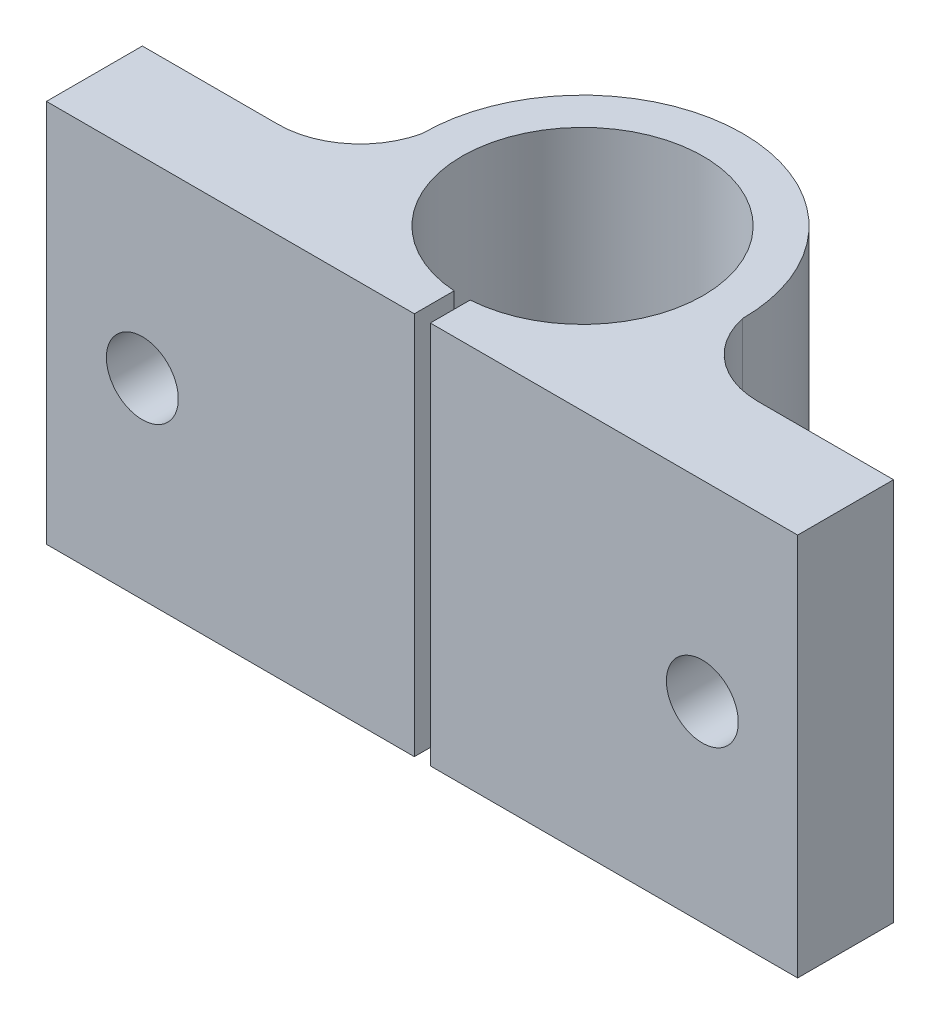
ISO-10303-21;
HEADER;
FILE_DESCRIPTION(('STEP AP214'),'2;1');
FILE_NAME('part.step','',(''),(''),'','','');
FILE_SCHEMA(('AUTOMOTIVE_DESIGN { 1 0 10303 214 1 1 1 1 }'));
ENDSEC;
DATA;
#1=APPLICATION_CONTEXT('core data for automotive mechanical design processes');
#2=APPLICATION_PROTOCOL_DEFINITION('international standard','automotive_design',2000,#1);
#3=PRODUCT_CONTEXT('',#1,'mechanical');
#4=PRODUCT('Part','Part','',(#3));
#5=PRODUCT_RELATED_PRODUCT_CATEGORY('part','',(#4));
#6=PRODUCT_DEFINITION_FORMATION('','',#4);
#7=PRODUCT_DEFINITION_CONTEXT('part definition',#1,'design');
#8=PRODUCT_DEFINITION('design','',#6,#7);
#9=PRODUCT_DEFINITION_SHAPE('','',#8);
#10=(LENGTH_UNIT() NAMED_UNIT(*) SI_UNIT(.MILLI.,.METRE.));
#11=(NAMED_UNIT(*) PLANE_ANGLE_UNIT() SI_UNIT($,.RADIAN.));
#12=(NAMED_UNIT(*) SI_UNIT($,.STERADIAN.) SOLID_ANGLE_UNIT());
#13=UNCERTAINTY_MEASURE_WITH_UNIT(LENGTH_MEASURE(1.E-05),#10,'distance_accuracy_value','');
#14=(GEOMETRIC_REPRESENTATION_CONTEXT(3) GLOBAL_UNCERTAINTY_ASSIGNED_CONTEXT((#13)) GLOBAL_UNIT_ASSIGNED_CONTEXT((#10,
#11,#12)) REPRESENTATION_CONTEXT('',''));
#15=CARTESIAN_POINT('',(0.,0.,0.));
#16=DIRECTION('',(0.,0.,1.));
#17=DIRECTION('',(1.,0.,0.));
#18=AXIS2_PLACEMENT_3D('',#15,#16,#17);
#19=CARTESIAN_POINT('',(41.0372666212457,12.,0.));
#20=DIRECTION('',(0.,0.,-1.));
#21=DIRECTION('',(-1.,0.,0.));
#22=AXIS2_PLACEMENT_3D('',#19,#20,#21);
#23=CYLINDRICAL_SURFACE('',#22,2.25000000000008);
#24=CARTESIAN_POINT('',(41.0372666212457,12.,0.));
#25=DIRECTION('',(0.,0.,-1.));
#26=DIRECTION('',(-1.,0.,0.));
#27=AXIS2_PLACEMENT_3D('',#24,#25,#26);
#28=CIRCLE('',#27,2.25000000000008);
#29=CARTESIAN_POINT('',(38.7872666212456,12.,0.));
#30=VERTEX_POINT('',#29);
#31=EDGE_CURVE('E143',#30,#30,#28,.T.);
#32=ORIENTED_EDGE('',*,*,#31,.F.);
#33=EDGE_LOOP('',(#32));
#34=FACE_BOUND('',#33,.T.);
#35=CARTESIAN_POINT('',(41.0372666212457,12.,-6.));
#36=DIRECTION('',(0.,0.,-1.));
#37=DIRECTION('',(-1.,0.,0.));
#38=AXIS2_PLACEMENT_3D('',#35,#36,#37);
#39=CIRCLE('',#38,2.25000000000008);
#40=CARTESIAN_POINT('',(38.7872666212456,12.,-6.));
#41=VERTEX_POINT('',#40);
#42=EDGE_CURVE('E20',#41,#41,#39,.F.);
#43=ORIENTED_EDGE('',*,*,#42,.F.);
#44=EDGE_LOOP('',(#43));
#45=FACE_BOUND('',#44,.T.);
#46=ADVANCED_FACE('F16',(#34,#45),#23,.F.);
#47=CARTESIAN_POINT('',(24.0186333106229,0.,0.));
#48=DIRECTION('',(-1.,0.,0.));
#49=DIRECTION('',(0.,1.,0.));
#50=AXIS2_PLACEMENT_3D('',#47,#48,#49);
#51=PLANE('',#50);
#52=DIRECTION('',(0.,-1.,0.));
#53=VECTOR('',#52,1.);
#54=CARTESIAN_POINT('',(24.0186333106229,12.,0.));
#55=LINE('',#54,#53);
#56=CARTESIAN_POINT('',(24.0186333106229,24.,0.));
#57=VERTEX_POINT('',#56);
#58=CARTESIAN_POINT('',(24.0186333106229,0.,0.));
#59=VERTEX_POINT('',#58);
#60=EDGE_CURVE('E153',#57,#59,#55,.T.);
#61=ORIENTED_EDGE('',*,*,#60,.F.);
#62=DIRECTION('',(0.,0.,1.));
#63=VECTOR('',#62,1.);
#64=CARTESIAN_POINT('',(24.0186333106229,24.,-10.1229485983166));
#65=LINE('',#64,#63);
#66=CARTESIAN_POINT('',(24.0186333106229,24.,-2.48929586881175));
#67=VERTEX_POINT('',#66);
#68=EDGE_CURVE('E201',#67,#57,#65,.T.);
#69=ORIENTED_EDGE('',*,*,#68,.F.);
#70=DIRECTION('',(0.,1.,0.));
#71=VECTOR('',#70,1.);
#72=CARTESIAN_POINT('',(24.0186333106229,12.,-2.48929586881172));
#73=LINE('',#72,#71);
#74=CARTESIAN_POINT('',(24.0186333106229,0.,-2.48929586881175));
#75=VERTEX_POINT('',#74);
#76=EDGE_CURVE('E121',#75,#67,#73,.T.);
#77=ORIENTED_EDGE('',*,*,#76,.F.);
#78=DIRECTION('',(0.,0.,-1.));
#79=VECTOR('',#78,1.);
#80=CARTESIAN_POINT('',(24.0186333106229,0.,-10.1229485983166));
#81=LINE('',#80,#79);
#82=EDGE_CURVE('E186',#59,#75,#81,.T.);
#83=ORIENTED_EDGE('',*,*,#82,.F.);
#84=EDGE_LOOP('',(#61,#69,#77,#83));
#85=FACE_BOUND('',#84,.T.);
#86=ADVANCED_FACE('F311',(#85),#51,.T.);
#87=CARTESIAN_POINT('',(23.5186333106229,0.,-10.022721384472));
#88=DIRECTION('',(0.,1.,0.));
#89=DIRECTION('',(0.,0.,1.));
#90=AXIS2_PLACEMENT_3D('',#87,#88,#89);
#91=CYLINDRICAL_SURFACE('',#90,7.55000000000001);
#92=DIRECTION('',(0.,1.,0.));
#93=VECTOR('',#92,1.);
#94=CARTESIAN_POINT('',(23.0186333106229,12.,-2.48929586881172));
#95=LINE('',#94,#93);
#96=CARTESIAN_POINT('',(23.0186333106229,0.,-2.48929586881175));
#97=VERTEX_POINT('',#96);
#98=CARTESIAN_POINT('',(23.0186333106229,24.,-2.48929586881175));
#99=VERTEX_POINT('',#98);
#100=EDGE_CURVE('E151',#97,#99,#95,.T.);
#101=ORIENTED_EDGE('',*,*,#100,.F.);
#102=CARTESIAN_POINT('',(23.5186333106229,0.,-10.022721384472));
#103=DIRECTION('',(0.,1.,0.));
#104=DIRECTION('',(0.,0.,1.));
#105=AXIS2_PLACEMENT_3D('',#102,#103,#104);
#106=CIRCLE('',#105,7.55000000000001);
#107=EDGE_CURVE('E181',#75,#97,#106,.T.);
#108=ORIENTED_EDGE('',*,*,#107,.F.);
#109=ORIENTED_EDGE('',*,*,#76,.T.);
#110=CARTESIAN_POINT('',(23.5186333106229,24.,-10.022721384472));
#111=DIRECTION('',(0.,1.,0.));
#112=DIRECTION('',(0.,0.,1.));
#113=AXIS2_PLACEMENT_3D('',#110,#111,#112);
#114=CIRCLE('',#113,7.55000000000001);
#115=EDGE_CURVE('E187',#99,#67,#114,.F.);
#116=ORIENTED_EDGE('',*,*,#115,.F.);
#117=EDGE_LOOP('',(#101,#108,#109,#116));
#118=FACE_BOUND('',#117,.T.);
#119=ADVANCED_FACE('F309',(#118),#91,.F.);
#120=CARTESIAN_POINT('',(23.5186333106229,24.,-10.0227213844719));
#121=DIRECTION('',(0.,-1.,0.));
#122=DIRECTION('',(0.,0.,-1.));
#123=AXIS2_PLACEMENT_3D('',#120,#121,#122);
#124=CYLINDRICAL_SURFACE('',#123,10.0227213844719);
#125=CARTESIAN_POINT('',(23.5186333106229,24.,-10.0227213844719));
#126=DIRECTION('',(0.,-1.,0.));
#127=DIRECTION('',(0.,0.,-1.));
#128=AXIS2_PLACEMENT_3D('',#125,#126,#127);
#129=CIRCLE('',#128,10.0227213844719);
#130=CARTESIAN_POINT('',(33.5413546555967,24.,-10.0218315772519));
#131=VERTEX_POINT('',#130);
#132=CARTESIAN_POINT('',(13.495947389742,24.,-9.99605901160398));
#133=VERTEX_POINT('',#132);
#134=EDGE_CURVE('E124',#131,#133,#129,.F.);
#135=ORIENTED_EDGE('',*,*,#134,.F.);
#136=DIRECTION('',(0.,1.,0.));
#137=VECTOR('',#136,1.);
#138=CARTESIAN_POINT('',(33.5413546555967,12.,-10.0218315772517));
#139=LINE('',#138,#137);
#140=CARTESIAN_POINT('',(33.5413546555967,0.,-10.0218315772519));
#141=VERTEX_POINT('',#140);
#142=EDGE_CURVE('E109',#141,#131,#139,.T.);
#143=ORIENTED_EDGE('',*,*,#142,.F.);
#144=CARTESIAN_POINT('',(23.5186333106229,0.,-10.0227213844719));
#145=DIRECTION('',(0.,-1.,0.));
#146=DIRECTION('',(0.,0.,-1.));
#147=AXIS2_PLACEMENT_3D('',#144,#145,#146);
#148=CIRCLE('',#147,10.0227213844719);
#149=CARTESIAN_POINT('',(13.495947389742,0.,-9.99605901160399));
#150=VERTEX_POINT('',#149);
#151=EDGE_CURVE('E174',#150,#141,#148,.T.);
#152=ORIENTED_EDGE('',*,*,#151,.F.);
#153=DIRECTION('',(0.,-1.,0.));
#154=VECTOR('',#153,1.);
#155=CARTESIAN_POINT('',(13.495947389742,12.,-9.99605901160398));
#156=LINE('',#155,#154);
#157=EDGE_CURVE('E126',#133,#150,#156,.T.);
#158=ORIENTED_EDGE('',*,*,#157,.F.);
#159=EDGE_LOOP('',(#135,#143,#152,#158));
#160=FACE_BOUND('',#159,.T.);
#161=ADVANCED_FACE('F125',(#160),#124,.T.);
#162=CARTESIAN_POINT('',(38.5000000000001,0.,-11.0677523541657));
#163=DIRECTION('',(0.,1.,0.));
#164=DIRECTION('',(0.,0.,1.));
#165=AXIS2_PLACEMENT_3D('',#162,#163,#164);
#166=CYLINDRICAL_SURFACE('',#165,5.06775235416581);
#167=CARTESIAN_POINT('',(38.5000000000001,24.,-11.0677523541657));
#168=DIRECTION('',(0.,1.,0.));
#169=DIRECTION('',(0.,0.,1.));
#170=AXIS2_PLACEMENT_3D('',#167,#168,#169);
#171=CIRCLE('',#170,5.06775235416581);
#172=CARTESIAN_POINT('',(38.5,24.,-6.00000000000001));
#173=VERTEX_POINT('',#172);
#174=EDGE_CURVE('E113',#173,#131,#171,.F.);
#175=ORIENTED_EDGE('',*,*,#174,.F.);
#176=DIRECTION('',(0.,1.,0.));
#177=VECTOR('',#176,1.);
#178=CARTESIAN_POINT('',(38.4999999999999,12.,-6.));
#179=LINE('',#178,#177);
#180=CARTESIAN_POINT('',(38.5,0.,-6.));
#181=VERTEX_POINT('',#180);
#182=EDGE_CURVE('E104',#181,#173,#179,.T.);
#183=ORIENTED_EDGE('',*,*,#182,.F.);
#184=CARTESIAN_POINT('',(38.5000000000001,0.,-11.0677523541657));
#185=DIRECTION('',(0.,1.,0.));
#186=DIRECTION('',(0.,0.,1.));
#187=AXIS2_PLACEMENT_3D('',#184,#185,#186);
#188=CIRCLE('',#187,5.06775235416581);
#189=EDGE_CURVE('E116',#141,#181,#188,.T.);
#190=ORIENTED_EDGE('',*,*,#189,.F.);
#191=ORIENTED_EDGE('',*,*,#142,.T.);
#192=EDGE_LOOP('',(#175,#183,#190,#191));
#193=FACE_BOUND('',#192,.T.);
#194=ADVANCED_FACE('F111',(#193),#166,.F.);
#195=CARTESIAN_POINT('',(47.,0.,-6.));
#196=DIRECTION('',(0.,0.,-1.));
#197=DIRECTION('',(-1.,0.,0.));
#198=AXIS2_PLACEMENT_3D('',#195,#196,#197);
#199=PLANE('',#198);
#200=ORIENTED_EDGE('',*,*,#42,.T.);
#201=EDGE_LOOP('',(#200));
#202=FACE_BOUND('',#201,.T.);
#203=DIRECTION('',(-1.,0.,0.));
#204=VECTOR('',#203,1.);
#205=CARTESIAN_POINT('',(23.5,24.,-6.00000000000001));
#206=LINE('',#205,#204);
#207=CARTESIAN_POINT('',(47.,24.,-6.));
#208=VERTEX_POINT('',#207);
#209=EDGE_CURVE('E135',#208,#173,#206,.T.);
#210=ORIENTED_EDGE('',*,*,#209,.F.);
#211=DIRECTION('',(0.,1.,0.));
#212=VECTOR('',#211,1.);
#213=CARTESIAN_POINT('',(47.,12.,-6.));
#214=LINE('',#213,#212);
#215=CARTESIAN_POINT('',(47.,0.,-6.));
#216=VERTEX_POINT('',#215);
#217=EDGE_CURVE('E161',#216,#208,#214,.T.);
#218=ORIENTED_EDGE('',*,*,#217,.F.);
#219=DIRECTION('',(1.,0.,0.));
#220=VECTOR('',#219,1.);
#221=CARTESIAN_POINT('',(23.5,0.,-6.));
#222=LINE('',#221,#220);
#223=EDGE_CURVE('E173',#181,#216,#222,.T.);
#224=ORIENTED_EDGE('',*,*,#223,.F.);
#225=ORIENTED_EDGE('',*,*,#182,.T.);
#226=EDGE_LOOP('',(#210,#218,#224,#225));
#227=FACE_BOUND('',#226,.T.);
#228=ADVANCED_FACE('F268',(#202,#227),#199,.T.);
#229=CARTESIAN_POINT('',(47.,0.,0.));
#230=DIRECTION('',(1.,0.,0.));
#231=DIRECTION('',(0.,0.,-1.));
#232=AXIS2_PLACEMENT_3D('',#229,#230,#231);
#233=PLANE('',#232);
#234=DIRECTION('',(0.,0.,-1.));
#235=VECTOR('',#234,1.);
#236=CARTESIAN_POINT('',(47.,24.,-10.1229485983166));
#237=LINE('',#236,#235);
#238=CARTESIAN_POINT('',(47.,24.,0.));
#239=VERTEX_POINT('',#238);
#240=EDGE_CURVE('E140',#239,#208,#237,.T.);
#241=ORIENTED_EDGE('',*,*,#240,.F.);
#242=DIRECTION('',(0.,1.,0.));
#243=VECTOR('',#242,1.);
#244=CARTESIAN_POINT('',(47.,12.,0.));
#245=LINE('',#244,#243);
#246=CARTESIAN_POINT('',(47.,0.,0.));
#247=VERTEX_POINT('',#246);
#248=EDGE_CURVE('E146',#247,#239,#245,.T.);
#249=ORIENTED_EDGE('',*,*,#248,.F.);
#250=DIRECTION('',(0.,0.,1.));
#251=VECTOR('',#250,1.);
#252=CARTESIAN_POINT('',(47.,0.,-10.1229485983166));
#253=LINE('',#252,#251);
#254=EDGE_CURVE('E229',#216,#247,#253,.T.);
#255=ORIENTED_EDGE('',*,*,#254,.F.);
#256=ORIENTED_EDGE('',*,*,#217,.T.);
#257=EDGE_LOOP('',(#241,#249,#255,#256));
#258=FACE_BOUND('',#257,.T.);
#259=ADVANCED_FACE('F267',(#258),#233,.T.);
#260=CARTESIAN_POINT('',(24.0186333106229,0.,0.));
#261=DIRECTION('',(0.,0.,1.));
#262=DIRECTION('',(1.,0.,0.));
#263=AXIS2_PLACEMENT_3D('',#260,#261,#262);
#264=PLANE('',#263);
#265=ORIENTED_EDGE('',*,*,#31,.T.);
#266=EDGE_LOOP('',(#265));
#267=FACE_BOUND('',#266,.T.);
#268=ORIENTED_EDGE('',*,*,#248,.T.);
#269=DIRECTION('',(1.,0.,0.));
#270=VECTOR('',#269,1.);
#271=CARTESIAN_POINT('',(23.5,24.,0.));
#272=LINE('',#271,#270);
#273=EDGE_CURVE('E164',#57,#239,#272,.T.);
#274=ORIENTED_EDGE('',*,*,#273,.F.);
#275=ORIENTED_EDGE('',*,*,#60,.T.);
#276=DIRECTION('',(-1.,0.,0.));
#277=VECTOR('',#276,1.);
#278=CARTESIAN_POINT('',(23.5,0.,0.));
#279=LINE('',#278,#277);
#280=EDGE_CURVE('E224',#247,#59,#279,.T.);
#281=ORIENTED_EDGE('',*,*,#280,.F.);
#282=EDGE_LOOP('',(#268,#274,#275,#281));
#283=FACE_BOUND('',#282,.T.);
#284=ADVANCED_FACE('F259',(#267,#283),#264,.T.);
#285=CARTESIAN_POINT('',(8.50000000000001,0.,-11.1210427356607));
#286=DIRECTION('',(0.,1.,0.));
#287=DIRECTION('',(0.,0.,1.));
#288=AXIS2_PLACEMENT_3D('',#285,#286,#287);
#289=CYLINDRICAL_SURFACE('',#288,5.12104273566066);
#290=CARTESIAN_POINT('',(8.50000000000001,24.,-11.1210427356607));
#291=DIRECTION('',(0.,1.,0.));
#292=DIRECTION('',(0.,0.,1.));
#293=AXIS2_PLACEMENT_3D('',#290,#291,#292);
#294=CIRCLE('',#293,5.12104273566066);
#295=CARTESIAN_POINT('',(8.50000000000001,24.,-6.));
#296=VERTEX_POINT('',#295);
#297=EDGE_CURVE('E130',#133,#296,#294,.F.);
#298=ORIENTED_EDGE('',*,*,#297,.F.);
#299=ORIENTED_EDGE('',*,*,#157,.T.);
#300=CARTESIAN_POINT('',(8.50000000000001,0.,-11.1210427356607));
#301=DIRECTION('',(0.,1.,0.));
#302=DIRECTION('',(0.,0.,1.));
#303=AXIS2_PLACEMENT_3D('',#300,#301,#302);
#304=CIRCLE('',#303,5.12104273566066);
#305=CARTESIAN_POINT('',(8.50000000000001,0.,-6.));
#306=VERTEX_POINT('',#305);
#307=EDGE_CURVE('E177',#306,#150,#304,.T.);
#308=ORIENTED_EDGE('',*,*,#307,.F.);
#309=DIRECTION('',(0.,-1.,0.));
#310=VECTOR('',#309,1.);
#311=CARTESIAN_POINT('',(8.50000000000001,12.,-6.));
#312=LINE('',#311,#310);
#313=EDGE_CURVE('E205',#296,#306,#312,.T.);
#314=ORIENTED_EDGE('',*,*,#313,.F.);
#315=EDGE_LOOP('',(#298,#299,#308,#314));
#316=FACE_BOUND('',#315,.T.);
#317=ADVANCED_FACE('F355',(#316),#289,.F.);
#318=CARTESIAN_POINT('',(23.0186333106229,24.,0.));
#319=DIRECTION('',(1.,0.,0.));
#320=DIRECTION('',(0.,-1.,0.));
#321=AXIS2_PLACEMENT_3D('',#318,#319,#320);
#322=PLANE('',#321);
#323=DIRECTION('',(0.,1.,0.));
#324=VECTOR('',#323,1.);
#325=CARTESIAN_POINT('',(23.0186333106229,12.,0.));
#326=LINE('',#325,#324);
#327=CARTESIAN_POINT('',(23.0186333106229,0.,0.));
#328=VERTEX_POINT('',#327);
#329=CARTESIAN_POINT('',(23.0186333106229,24.,0.));
#330=VERTEX_POINT('',#329);
#331=EDGE_CURVE('E209',#328,#330,#326,.T.);
#332=ORIENTED_EDGE('',*,*,#331,.F.);
#333=DIRECTION('',(0.,0.,1.));
#334=VECTOR('',#333,1.);
#335=CARTESIAN_POINT('',(23.0186333106229,0.,-10.1229485983166));
#336=LINE('',#335,#334);
#337=EDGE_CURVE('E185',#97,#328,#336,.T.);
#338=ORIENTED_EDGE('',*,*,#337,.F.);
#339=ORIENTED_EDGE('',*,*,#100,.T.);
#340=DIRECTION('',(0.,0.,-1.));
#341=VECTOR('',#340,1.);
#342=CARTESIAN_POINT('',(23.0186333106229,24.,-10.1229485983166));
#343=LINE('',#342,#341);
#344=EDGE_CURVE('E191',#330,#99,#343,.T.);
#345=ORIENTED_EDGE('',*,*,#344,.F.);
#346=EDGE_LOOP('',(#332,#338,#339,#345));
#347=FACE_BOUND('',#346,.T.);
#348=ADVANCED_FACE('F300',(#347),#322,.T.);
#349=CARTESIAN_POINT('',(0.,24.,-20.2458971966332));
#350=DIRECTION('',(0.,1.,0.));
#351=DIRECTION('',(0.,0.,1.));
#352=AXIS2_PLACEMENT_3D('',#349,#350,#351);
#353=PLANE('',#352);
#354=ORIENTED_EDGE('',*,*,#344,.T.);
#355=ORIENTED_EDGE('',*,*,#115,.T.);
#356=ORIENTED_EDGE('',*,*,#68,.T.);
#357=ORIENTED_EDGE('',*,*,#273,.T.);
#358=ORIENTED_EDGE('',*,*,#240,.T.);
#359=ORIENTED_EDGE('',*,*,#209,.T.);
#360=ORIENTED_EDGE('',*,*,#174,.T.);
#361=ORIENTED_EDGE('',*,*,#134,.T.);
#362=ORIENTED_EDGE('',*,*,#297,.T.);
#363=DIRECTION('',(1.,0.,0.));
#364=VECTOR('',#363,1.);
#365=CARTESIAN_POINT('',(4.25000000000001,24.,-6.));
#366=LINE('',#365,#364);
#367=CARTESIAN_POINT('',(0.,24.,-6.));
#368=VERTEX_POINT('',#367);
#369=EDGE_CURVE('E210',#368,#296,#366,.T.);
#370=ORIENTED_EDGE('',*,*,#369,.F.);
#371=DIRECTION('',(0.,0.,-1.));
#372=VECTOR('',#371,1.);
#373=CARTESIAN_POINT('',(0.,24.,-3.));
#374=LINE('',#373,#372);
#375=CARTESIAN_POINT('',(0.,24.,0.));
#376=VERTEX_POINT('',#375);
#377=EDGE_CURVE('E190',#376,#368,#374,.T.);
#378=ORIENTED_EDGE('',*,*,#377,.F.);
#379=DIRECTION('',(-1.,0.,0.));
#380=VECTOR('',#379,1.);
#381=CARTESIAN_POINT('',(11.5093166553115,24.,0.));
#382=LINE('',#381,#380);
#383=EDGE_CURVE('E242',#330,#376,#382,.T.);
#384=ORIENTED_EDGE('',*,*,#383,.F.);
#385=EDGE_LOOP('',(#354,#355,#356,#357,#358,#359,#360,#361,#362,#370,#378,#384));
#386=FACE_BOUND('',#385,.T.);
#387=ADVANCED_FACE('F133',(#386),#353,.T.);
#388=CARTESIAN_POINT('',(0.,0.,-6.));
#389=DIRECTION('',(-1.,0.,0.));
#390=DIRECTION('',(0.,0.,1.));
#391=AXIS2_PLACEMENT_3D('',#388,#389,#390);
#392=PLANE('',#391);
#393=ORIENTED_EDGE('',*,*,#377,.T.);
#394=DIRECTION('',(0.,1.,0.));
#395=VECTOR('',#394,1.);
#396=CARTESIAN_POINT('',(0.,12.,-6.));
#397=LINE('',#396,#395);
#398=CARTESIAN_POINT('',(0.,0.,-6.));
#399=VERTEX_POINT('',#398);
#400=EDGE_CURVE('E214',#399,#368,#397,.T.);
#401=ORIENTED_EDGE('',*,*,#400,.F.);
#402=DIRECTION('',(0.,0.,-1.));
#403=VECTOR('',#402,1.);
#404=CARTESIAN_POINT('',(0.,0.,-10.1229485983166));
#405=LINE('',#404,#403);
#406=CARTESIAN_POINT('',(0.,0.,0.));
#407=VERTEX_POINT('',#406);
#408=EDGE_CURVE('E36',#407,#399,#405,.T.);
#409=ORIENTED_EDGE('',*,*,#408,.F.);
#410=DIRECTION('',(0.,-1.,0.));
#411=VECTOR('',#410,1.);
#412=CARTESIAN_POINT('',(0.,12.,0.));
#413=LINE('',#412,#411);
#414=EDGE_CURVE('E238',#376,#407,#413,.T.);
#415=ORIENTED_EDGE('',*,*,#414,.F.);
#416=EDGE_LOOP('',(#393,#401,#409,#415));
#417=FACE_BOUND('',#416,.T.);
#418=ADVANCED_FACE('F295',(#417),#392,.T.);
#419=CARTESIAN_POINT('',(0.,0.,0.));
#420=DIRECTION('',(0.,-1.,0.));
#421=DIRECTION('',(0.,0.,-1.));
#422=AXIS2_PLACEMENT_3D('',#419,#420,#421);
#423=PLANE('',#422);
#424=ORIENTED_EDGE('',*,*,#254,.T.);
#425=ORIENTED_EDGE('',*,*,#280,.T.);
#426=ORIENTED_EDGE('',*,*,#82,.T.);
#427=ORIENTED_EDGE('',*,*,#107,.T.);
#428=ORIENTED_EDGE('',*,*,#337,.T.);
#429=DIRECTION('',(1.,0.,0.));
#430=VECTOR('',#429,1.);
#431=CARTESIAN_POINT('',(11.5093166553115,0.,0.));
#432=LINE('',#431,#430);
#433=EDGE_CURVE('E170',#407,#328,#432,.T.);
#434=ORIENTED_EDGE('',*,*,#433,.F.);
#435=ORIENTED_EDGE('',*,*,#408,.T.);
#436=DIRECTION('',(-1.,0.,0.));
#437=VECTOR('',#436,1.);
#438=CARTESIAN_POINT('',(4.25000000000001,0.,-6.));
#439=LINE('',#438,#437);
#440=EDGE_CURVE('E218',#306,#399,#439,.T.);
#441=ORIENTED_EDGE('',*,*,#440,.F.);
#442=ORIENTED_EDGE('',*,*,#307,.T.);
#443=ORIENTED_EDGE('',*,*,#151,.T.);
#444=ORIENTED_EDGE('',*,*,#189,.T.);
#445=ORIENTED_EDGE('',*,*,#223,.T.);
#446=EDGE_LOOP('',(#424,#425,#426,#427,#428,#434,#435,#441,#442,#443,#444,#445));
#447=FACE_BOUND('',#446,.T.);
#448=ADVANCED_FACE('F263',(#447),#423,.T.);
#449=CARTESIAN_POINT('',(8.50000000000001,0.,-6.));
#450=DIRECTION('',(0.,0.,-1.));
#451=DIRECTION('',(-1.,0.,0.));
#452=AXIS2_PLACEMENT_3D('',#449,#450,#451);
#453=PLANE('',#452);
#454=CARTESIAN_POINT('',(6.,12.,-6.));
#455=DIRECTION('',(0.,0.,-1.));
#456=DIRECTION('',(-1.,0.,0.));
#457=AXIS2_PLACEMENT_3D('',#454,#455,#456);
#458=CIRCLE('',#457,2.24999999999999);
#459=CARTESIAN_POINT('',(3.75000000000001,12.,-6.));
#460=VERTEX_POINT('',#459);
#461=EDGE_CURVE('E27',#460,#460,#458,.T.);
#462=ORIENTED_EDGE('',*,*,#461,.F.);
#463=EDGE_LOOP('',(#462));
#464=FACE_BOUND('',#463,.T.);
#465=ORIENTED_EDGE('',*,*,#369,.T.);
#466=ORIENTED_EDGE('',*,*,#313,.T.);
#467=ORIENTED_EDGE('',*,*,#440,.T.);
#468=ORIENTED_EDGE('',*,*,#400,.T.);
#469=EDGE_LOOP('',(#465,#466,#467,#468));
#470=FACE_BOUND('',#469,.T.);
#471=ADVANCED_FACE('F286',(#464,#470),#453,.T.);
#472=CARTESIAN_POINT('',(0.,0.,0.));
#473=DIRECTION('',(0.,0.,1.));
#474=DIRECTION('',(1.,0.,0.));
#475=AXIS2_PLACEMENT_3D('',#472,#473,#474);
#476=PLANE('',#475);
#477=CARTESIAN_POINT('',(6.,12.,0.));
#478=DIRECTION('',(0.,0.,-1.));
#479=DIRECTION('',(-1.,0.,0.));
#480=AXIS2_PLACEMENT_3D('',#477,#478,#479);
#481=CIRCLE('',#480,2.24999999999999);
#482=CARTESIAN_POINT('',(3.75000000000001,12.,0.));
#483=VERTEX_POINT('',#482);
#484=EDGE_CURVE('E10',#483,#483,#481,.F.);
#485=ORIENTED_EDGE('',*,*,#484,.F.);
#486=EDGE_LOOP('',(#485));
#487=FACE_BOUND('',#486,.T.);
#488=ORIENTED_EDGE('',*,*,#414,.T.);
#489=ORIENTED_EDGE('',*,*,#433,.T.);
#490=ORIENTED_EDGE('',*,*,#331,.T.);
#491=ORIENTED_EDGE('',*,*,#383,.T.);
#492=EDGE_LOOP('',(#488,#489,#490,#491));
#493=FACE_BOUND('',#492,.T.);
#494=ADVANCED_FACE('F281',(#487,#493),#476,.T.);
#495=CARTESIAN_POINT('',(6.,12.,0.));
#496=DIRECTION('',(0.,0.,-1.));
#497=DIRECTION('',(-1.,0.,0.));
#498=AXIS2_PLACEMENT_3D('',#495,#496,#497);
#499=CYLINDRICAL_SURFACE('',#498,2.24999999999999);
#500=ORIENTED_EDGE('',*,*,#484,.T.);
#501=EDGE_LOOP('',(#500));
#502=FACE_BOUND('',#501,.T.);
#503=ORIENTED_EDGE('',*,*,#461,.T.);
#504=EDGE_LOOP('',(#503));
#505=FACE_BOUND('',#504,.T.);
#506=ADVANCED_FACE('F18',(#502,#505),#499,.F.);
#507=CLOSED_SHELL('',(#46,#86,#119,#161,#194,#228,#259,#284,#317,#348,#387,#418,#448,#471,#494,#506));
#508=MANIFOLD_SOLID_BREP('B1',#507);
#509=ADVANCED_BREP_SHAPE_REPRESENTATION('',(#18,#508),#14);
#510=SHAPE_DEFINITION_REPRESENTATION(#9,#509);
ENDSEC;
END-ISO-10303-21;
